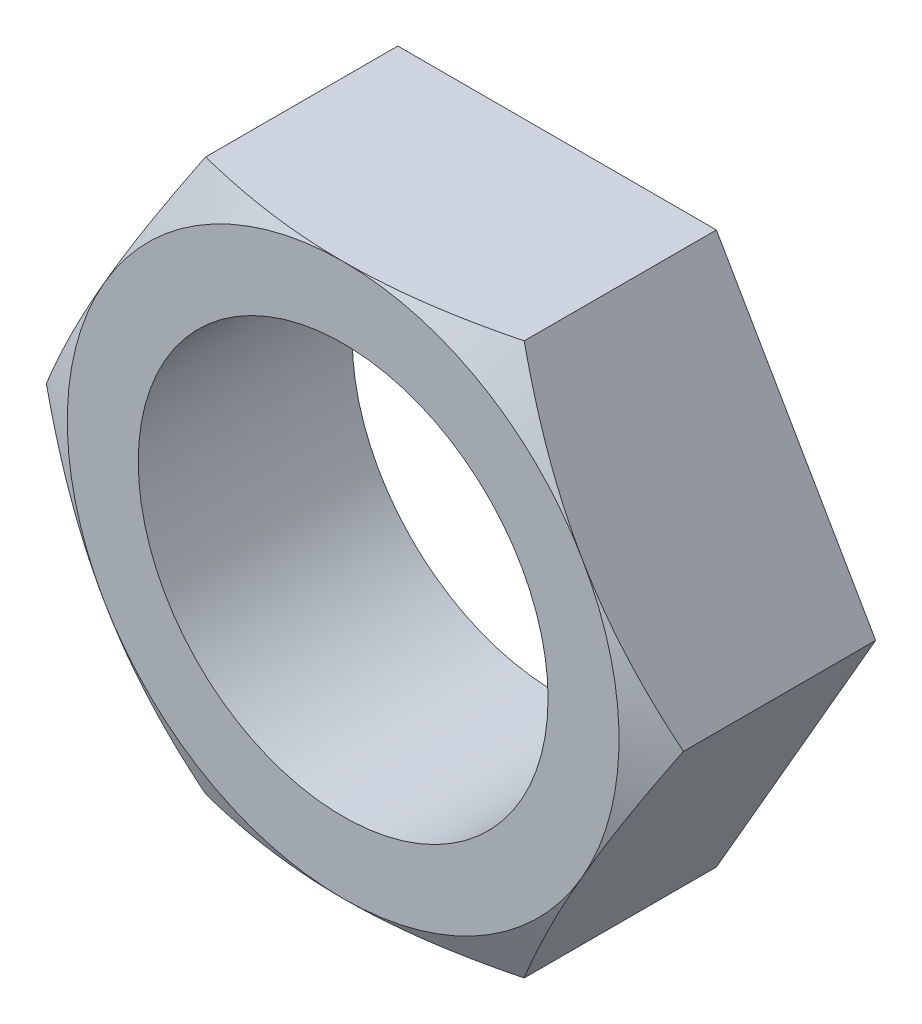
ISO-10303-21;
HEADER;
FILE_DESCRIPTION(('STEP AP214'),'2;1');
FILE_NAME('part.step','',(''),(''),'','','');
FILE_SCHEMA(('AUTOMOTIVE_DESIGN { 1 0 10303 214 1 1 1 1 }'));
ENDSEC;
DATA;
#1=APPLICATION_CONTEXT('core data for automotive mechanical design processes');
#2=APPLICATION_PROTOCOL_DEFINITION('international standard','automotive_design',2000,#1);
#3=PRODUCT_CONTEXT('',#1,'mechanical');
#4=PRODUCT('Part','Part','',(#3));
#5=PRODUCT_RELATED_PRODUCT_CATEGORY('part','',(#4));
#6=PRODUCT_DEFINITION_FORMATION('','',#4);
#7=PRODUCT_DEFINITION_CONTEXT('part definition',#1,'design');
#8=PRODUCT_DEFINITION('design','',#6,#7);
#9=PRODUCT_DEFINITION_SHAPE('','',#8);
#10=(LENGTH_UNIT() NAMED_UNIT(*) SI_UNIT(.MILLI.,.METRE.));
#11=(NAMED_UNIT(*) PLANE_ANGLE_UNIT() SI_UNIT($,.RADIAN.));
#12=(NAMED_UNIT(*) SI_UNIT($,.STERADIAN.) SOLID_ANGLE_UNIT());
#13=UNCERTAINTY_MEASURE_WITH_UNIT(LENGTH_MEASURE(1.E-05),#10,'distance_accuracy_value','');
#14=(GEOMETRIC_REPRESENTATION_CONTEXT(3) GLOBAL_UNCERTAINTY_ASSIGNED_CONTEXT((#13)) GLOBAL_UNIT_ASSIGNED_CONTEXT((#10,
#11,#12)) REPRESENTATION_CONTEXT('',''));
#15=CARTESIAN_POINT('',(0.,0.,0.));
#16=DIRECTION('',(0.,0.,1.));
#17=DIRECTION('',(1.,0.,0.));
#18=AXIS2_PLACEMENT_3D('',#15,#16,#17);
#19=CARTESIAN_POINT('',(147.07060395356,1381.2218281699,123.976608288254));
#20=DIRECTION('',(0.866025403784434,-0.500000000000007,0.));
#21=DIRECTION('',(0.500000000000007,0.866025403784434,0.));
#22=AXIS2_PLACEMENT_3D('',#19,#20,#21);
#23=PLANE('',#22);
#24=CARTESIAN_POINT('',(147.070719423614,1381.2220281699,21.3919278692892));
#25=CARTESIAN_POINT('',(146.580470792881,1380.37289263313,21.6417046290043));
#26=CARTESIAN_POINT('',(146.088283996036,1379.52040009418,21.8769733663679));
#27=CARTESIAN_POINT('',(145.099927293063,1377.80851606863,22.3137023874053));
#28=CARTESIAN_POINT('',(144.603755497762,1376.94912130988,22.5151455063238));
#29=CARTESIAN_POINT('',(143.607012208054,1375.22271129001,22.8794628681463));
#30=CARTESIAN_POINT('',(143.10643489137,1374.35568594439,23.0422741440836));
#31=CARTESIAN_POINT('',(142.102261938455,1372.61640737036,23.3240694413077));
#32=CARTESIAN_POINT('',(141.598666825295,1371.74415504792,23.4430608465895));
#33=CARTESIAN_POINT('',(140.600914799346,1370.01599784562,23.6310032152789));
#34=CARTESIAN_POINT('',(140.106810058655,1369.16018333049,23.7010513372338));
#35=CARTESIAN_POINT('',(139.117443596861,1367.44655035135,23.7929958306863));
#36=CARTESIAN_POINT('',(138.622181822608,1366.5887317953,23.8148899448458));
#37=CARTESIAN_POINT('',(137.632281032135,1364.87417333175,23.8096982247025));
#38=CARTESIAN_POINT('',(137.137641937828,1364.017433289,23.782667033308));
#39=CARTESIAN_POINT('',(136.14963623759,1362.30615721802,23.6807404823272));
#40=CARTESIAN_POINT('',(135.656269529059,1361.45162101208,23.6058491113049));
#41=CARTESIAN_POINT('',(134.919890015754,1360.17617428138,23.4600252252282));
#42=CARTESIAN_POINT('',(134.6760003469,1359.75374498349,23.4061148153264));
#43=CARTESIAN_POINT('',(134.188884668478,1358.9100358793,23.2876390773393));
#44=CARTESIAN_POINT('',(133.945658615883,1358.48875599848,23.2230744575704));
#45=CARTESIAN_POINT('',(133.21699643025,1357.22667607141,23.0140896973095));
#46=CARTESIAN_POINT('',(132.73264065915,1356.38774726692,22.8543916470237));
#47=CARTESIAN_POINT('',(131.761505215448,1354.7056913374,22.4964947671884));
#48=CARTESIAN_POINT('',(131.274766865267,1353.8626357849,22.2978544405525));
#49=CARTESIAN_POINT('',(130.30516492159,1352.18323595533,21.8680955136689));
#50=CARTESIAN_POINT('',(129.822299286033,1351.34688814132,21.6369954077479));
#51=CARTESIAN_POINT('',(129.341288483506,1350.51375299235,21.3919278692892));
#52=B_SPLINE_CURVE_WITH_KNOTS('',3,(#24,#25,#26,#27,#28,#29,#30,#31,#32,#33,#34,#35,#36,#37,#38,
#39,#40,#41,#42,#43,#44,#45,#46,#47,#48,#49,#50,#51),.UNSPECIFIED.,.F.,.F.,(4,2,2,2,2,2,2,2,2,2,
2,2,2,4),(0.,3.03558638203784,6.07270854259094,9.11474748966,12.1562735942813,15.1272181043355,
18.0983018817831,21.0660694103388,24.0335896438093,25.5057384868417,26.9777894974265,
29.922279495167,32.9023144399483,35.8806583121157),.UNSPECIFIED.);
#53=CARTESIAN_POINT('',(147.07060395356,1381.2218281699,21.3919867045077));
#54=VERTEX_POINT('',#53);
#55=CARTESIAN_POINT('',(138.20600395356,1365.86789058112,23.8125000000008));
#56=VERTEX_POINT('',#55);
#57=EDGE_CURVE('E109',#54,#56,#52,.T.);
#58=ORIENTED_EDGE('',*,*,#57,.F.);
#59=DIRECTION('',(0.,0.,-1.));
#60=VECTOR('',#59,1.);
#61=CARTESIAN_POINT('',(147.07060395356,1381.2218281699,123.976608288254));
#62=LINE('',#61,#60);
#63=CARTESIAN_POINT('',(147.07060395356,1381.2218281699,0.));
#64=VERTEX_POINT('',#63);
#65=EDGE_CURVE('E233',#54,#64,#62,.T.);
#66=ORIENTED_EDGE('',*,*,#65,.T.);
#67=DIRECTION('',(-0.500000000000007,-0.866025403784434,0.));
#68=VECTOR('',#67,1.);
#69=CARTESIAN_POINT('',(147.07060395356,1381.2218281699,0.));
#70=LINE('',#69,#68);
#71=CARTESIAN_POINT('',(129.34140395356,1350.51395299235,0.));
#72=VERTEX_POINT('',#71);
#73=EDGE_CURVE('E234',#64,#72,#70,.T.);
#74=ORIENTED_EDGE('',*,*,#73,.T.);
#75=DIRECTION('',(0.,0.,-1.));
#76=VECTOR('',#75,1.);
#77=CARTESIAN_POINT('',(129.34140395356,1350.51395299235,123.976608288254));
#78=LINE('',#77,#76);
#79=CARTESIAN_POINT('',(129.34140395356,1350.51395299235,21.3919867045076));
#80=VERTEX_POINT('',#79);
#81=EDGE_CURVE('E137',#80,#72,#78,.T.);
#82=ORIENTED_EDGE('',*,*,#81,.F.);
#83=EDGE_CURVE('E120',#56,#80,#52,.T.);
#84=ORIENTED_EDGE('',*,*,#83,.F.);
#85=EDGE_LOOP('',(#58,#66,#74,#82,#84));
#86=FACE_BOUND('',#85,.T.);
#87=ADVANCED_FACE('F37',(#86),#23,.F.);
#88=CARTESIAN_POINT('',(129.34140395356,1350.51395299235,123.976608288254));
#89=DIRECTION('',(0.866025403784442,0.499999999999994,0.));
#90=DIRECTION('',(-0.499999999999994,0.866025403784442,0.));
#91=AXIS2_PLACEMENT_3D('',#88,#89,#90);
#92=PLANE('',#91);
#93=CARTESIAN_POINT('',(129.341288483506,1350.51415299235,21.3919278692892));
#94=CARTESIAN_POINT('',(129.831537114238,1349.66501745558,21.6417046290042));
#95=CARTESIAN_POINT('',(130.323723911084,1348.81252491663,21.8769733663678));
#96=CARTESIAN_POINT('',(131.312080614057,1347.10064089108,22.3137023874053));
#97=CARTESIAN_POINT('',(131.808252409357,1346.24124613233,22.5151455063237));
#98=CARTESIAN_POINT('',(132.804995699065,1344.51483611246,22.8794628681462));
#99=CARTESIAN_POINT('',(133.30557301575,1343.64781076684,23.0422741440836));
#100=CARTESIAN_POINT('',(134.309745968665,1341.90853219281,23.3240694413077));
#101=CARTESIAN_POINT('',(134.813341081825,1341.03627987037,23.4430608465895));
#102=CARTESIAN_POINT('',(135.811093107774,1339.30812266807,23.6310032152788));
#103=CARTESIAN_POINT('',(136.305197848465,1338.45230815294,23.7010513372338));
#104=CARTESIAN_POINT('',(137.294564310259,1336.7386751738,23.7929958306862));
#105=CARTESIAN_POINT('',(137.789826084512,1335.88085661775,23.8148899448458));
#106=CARTESIAN_POINT('',(138.779726874984,1334.1662981542,23.8096982247025));
#107=CARTESIAN_POINT('',(139.274365969291,1333.30955811145,23.782667033308));
#108=CARTESIAN_POINT('',(140.26237166953,1331.59828204047,23.6807404823272));
#109=CARTESIAN_POINT('',(140.75573837806,1330.74374583453,23.6058491113049));
#110=CARTESIAN_POINT('',(141.492117891365,1329.46829910383,23.4600252252282));
#111=CARTESIAN_POINT('',(141.73600756022,1329.04586980594,23.4061148153264));
#112=CARTESIAN_POINT('',(142.223123238642,1328.20216070175,23.2876390773393));
#113=CARTESIAN_POINT('',(142.466349291236,1327.78088082093,23.2230744575704));
#114=CARTESIAN_POINT('',(143.195011476869,1326.51880089386,23.0140896973095));
#115=CARTESIAN_POINT('',(143.679367247969,1325.67987208937,22.8543916470237));
#116=CARTESIAN_POINT('',(144.650502691672,1323.99781615985,22.4964947671883));
#117=CARTESIAN_POINT('',(145.137241041852,1323.15476060735,22.2978544405525));
#118=CARTESIAN_POINT('',(146.10684298553,1321.47536077778,21.8680955136689));
#119=CARTESIAN_POINT('',(146.589708621086,1320.63901296377,21.6369954077479));
#120=CARTESIAN_POINT('',(147.070719423613,1319.8058778148,21.3919278692892));
#121=B_SPLINE_CURVE_WITH_KNOTS('',3,(#93,#94,#95,#96,#97,#98,#99,#100,#101,#102,#103,#104,#105,
#106,#107,#108,#109,#110,#111,#112,#113,#114,#115,#116,#117,#118,#119,#120),.UNSPECIFIED.,.F.,
.F.,(4,2,2,2,2,2,2,2,2,2,2,2,2,4),(0.,3.03558638203781,6.0727085425909,9.11474748965993,
12.1562735942812,15.1272181043356,18.0983018817832,21.0660694103389,24.0335896438094,
25.5057384868415,26.9777894974267,29.9222794951672,32.9023144399483,35.8806583121156),.UNSPECIFIED.);
#122=CARTESIAN_POINT('',(138.20600395356,1335.16001540357,23.8125000000008));
#123=VERTEX_POINT('',#122);
#124=EDGE_CURVE('E127',#80,#123,#121,.T.);
#125=ORIENTED_EDGE('',*,*,#124,.F.);
#126=ORIENTED_EDGE('',*,*,#81,.T.);
#127=DIRECTION('',(0.499999999999994,-0.866025403784442,0.));
#128=VECTOR('',#127,1.);
#129=CARTESIAN_POINT('',(129.34140395356,1350.51395299235,0.));
#130=LINE('',#129,#128);
#131=CARTESIAN_POINT('',(147.070603953559,1319.8060778148,0.));
#132=VERTEX_POINT('',#131);
#133=EDGE_CURVE('E249',#72,#132,#130,.T.);
#134=ORIENTED_EDGE('',*,*,#133,.T.);
#135=DIRECTION('',(0.,0.,-1.));
#136=VECTOR('',#135,1.);
#137=CARTESIAN_POINT('',(147.070603953559,1319.8060778148,123.976608288254));
#138=LINE('',#137,#136);
#139=CARTESIAN_POINT('',(147.070603953559,1319.8060778148,21.3919867045077));
#140=VERTEX_POINT('',#139);
#141=EDGE_CURVE('E204',#140,#132,#138,.T.);
#142=ORIENTED_EDGE('',*,*,#141,.F.);
#143=EDGE_CURVE('E138',#123,#140,#121,.T.);
#144=ORIENTED_EDGE('',*,*,#143,.F.);
#145=EDGE_LOOP('',(#125,#126,#134,#142,#144));
#146=FACE_BOUND('',#145,.T.);
#147=ADVANCED_FACE('F192',(#146),#92,.F.);
#148=CARTESIAN_POINT('',(147.070603953559,1319.8060778148,123.976608288254));
#149=DIRECTION('',(0.,1.,0.));
#150=DIRECTION('',(-1.,0.,0.));
#151=AXIS2_PLACEMENT_3D('',#148,#149,#150);
#152=PLANE('',#151);
#153=CARTESIAN_POINT('',(117.771709021794,1319.8060778148,10.8409567621768));
#154=CARTESIAN_POINT('',(118.456911807854,1319.8060778148,11.1332749209905));
#155=CARTESIAN_POINT('',(119.142799303296,1319.8060778148,11.4239930974424));
#156=CARTESIAN_POINT('',(120.516086699451,1319.8060778148,12.001852866436));
#157=CARTESIAN_POINT('',(121.203486614713,1319.8060778148,12.2889944243928));
#158=CARTESIAN_POINT('',(122.580027360718,1319.8060778148,12.8593595943776));
#159=CARTESIAN_POINT('',(123.269168427127,1319.8060778148,13.1425826382681));
#160=CARTESIAN_POINT('',(124.649244401776,1319.8060778148,13.7046161150412));
#161=CARTESIAN_POINT('',(125.340179305927,1319.8060778148,13.9834265579677));
#162=CARTESIAN_POINT('',(127.421796474031,1319.8060778148,14.8148516356537));
#163=CARTESIAN_POINT('',(128.815462549204,1319.8060778148,15.3600354664249));
#164=CARTESIAN_POINT('',(131.612197010711,1319.8060778148,16.42563880378));
#165=CARTESIAN_POINT('',(133.0152650062,1319.8060778148,16.9460593325986));
#166=CARTESIAN_POINT('',(135.823309352538,1319.8060778148,17.9522574166504));
#167=CARTESIAN_POINT('',(137.228211056339,1319.8060778148,18.4382422110898));
#168=CARTESIAN_POINT('',(140.0511762563,1319.8060778148,19.3710139959994));
#169=CARTESIAN_POINT('',(141.469240674678,1319.8060778148,19.8177982166875));
#170=CARTESIAN_POINT('',(144.31828348994,1319.8060778148,20.6608160664175));
#171=CARTESIAN_POINT('',(145.749241074345,1319.8060778148,21.0571194547956));
#172=CARTESIAN_POINT('',(148.627149973403,1319.8060778148,21.7866205817215));
#173=CARTESIAN_POINT('',(150.074098105683,1319.8060778148,22.1198306457246));
#174=CARTESIAN_POINT('',(152.430331648247,1319.8060778148,22.5960899015803));
#175=CARTESIAN_POINT('',(153.334752254528,1319.8060778148,22.7632580244041));
#176=CARTESIAN_POINT('',(155.149219008547,1319.8060778148,23.0638467167844));
#177=CARTESIAN_POINT('',(156.059265017458,1319.8060778148,23.197268115783));
#178=CARTESIAN_POINT('',(157.883835527958,1319.8060778148,23.42691192005));
#179=CARTESIAN_POINT('',(158.798358805228,1319.8060778148,23.5231439759794));
#180=CARTESIAN_POINT('',(160.630757944938,1319.8060778148,23.6756764225213));
#181=CARTESIAN_POINT('',(161.548633791425,1319.8060778148,23.7319770028961));
#182=CARTESIAN_POINT('',(163.386507442713,1319.8060778148,23.8029000926338));
#183=CARTESIAN_POINT('',(164.306506126316,1319.8060778148,23.8175000573444));
#184=CARTESIAN_POINT('',(166.146199021455,1319.8060778148,23.8044811571944));
#185=CARTESIAN_POINT('',(167.0658932338,1319.8060778148,23.7768624054369));
#186=CARTESIAN_POINT('',(168.902986176128,1319.8060778148,23.6803064355593));
#187=CARTESIAN_POINT('',(169.8203851506,1319.8060778148,23.6113738243276));
#188=CARTESIAN_POINT('',(171.651374475858,1319.8060778148,23.4343128406343));
#189=CARTESIAN_POINT('',(172.564964743128,1319.8060778148,23.3261836132155));
#190=CARTESIAN_POINT('',(174.447081201838,1319.8060778148,23.0654414898965));
#191=CARTESIAN_POINT('',(175.415264447843,1319.8060778148,22.9103687047686));
#192=CARTESIAN_POINT('',(177.345078154972,1319.8060778148,22.5634158118414));
#193=CARTESIAN_POINT('',(178.306707777592,1319.8060778148,22.3715310823994));
#194=CARTESIAN_POINT('',(180.223431339038,1319.8060778148,21.9553572065387));
#195=CARTESIAN_POINT('',(181.178521416784,1319.8060778148,21.7310503993854));
#196=CARTESIAN_POINT('',(183.081624184154,1319.8060778148,21.2544637660428));
#197=CARTESIAN_POINT('',(184.029637085254,1319.8060778148,21.0021847793025));
#198=CARTESIAN_POINT('',(185.923233455325,1319.8060778148,20.4724108102008));
#199=CARTESIAN_POINT('',(186.868785994329,1319.8060778148,20.1948058011185));
#200=CARTESIAN_POINT('',(188.753554148018,1319.8060778148,19.6189165178223));
#201=CARTESIAN_POINT('',(189.69276971916,1319.8060778148,19.3206321016725));
#202=CARTESIAN_POINT('',(191.565169477271,1319.8060778148,18.7065206757264));
#203=CARTESIAN_POINT('',(192.498355112009,1319.8060778148,18.3906980658482));
#204=CARTESIAN_POINT('',(194.359492154287,1319.8060778148,17.7440384241465));
#205=CARTESIAN_POINT('',(195.287443579258,1319.8060778148,17.4132014423559));
#206=CARTESIAN_POINT('',(197.155106522538,1319.8060778148,16.7327061537367));
#207=CARTESIAN_POINT('',(198.094734079441,1319.8060778148,16.3828178891692));
#208=CARTESIAN_POINT('',(199.969673141043,1319.8060778148,15.6716813356268));
#209=CARTESIAN_POINT('',(200.904984642862,1319.8060778148,15.3104330390735));
#210=CARTESIAN_POINT('',(202.771843288172,1319.8060778148,14.5781611036866));
#211=CARTESIAN_POINT('',(203.703390162497,1319.8060778148,14.2071367796587));
#212=CARTESIAN_POINT('',(205.563092524498,1319.8060778148,13.4566813214079));
#213=CARTESIAN_POINT('',(206.491247995723,1319.8060778148,13.077250146469));
#214=CARTESIAN_POINT('',(208.333979859002,1319.8060778148,12.315478714202));
#215=CARTESIAN_POINT('',(209.248590400054,1319.8060778148,11.9332209761225));
#216=CARTESIAN_POINT('',(211.075196808108,1319.8060778148,11.1625061136868));
#217=CARTESIAN_POINT('',(211.987192667534,1319.8060778148,10.7740489713897));
#218=CARTESIAN_POINT('',(213.808628287385,1319.8060778148,9.99181335755288));
#219=CARTESIAN_POINT('',(214.718068627817,1319.8060778148,9.59803623533003));
#220=CARTESIAN_POINT('',(216.534853269485,1319.8060778148,8.80570673741764));
#221=CARTESIAN_POINT('',(217.442197597948,1319.8060778148,8.4071544241762));
#222=CARTESIAN_POINT('',(218.348621829151,1319.8060778148,8.00652975555705));
#223=B_SPLINE_CURVE_WITH_KNOTS('',3,(#153,#154,#155,#156,#157,#158,#159,#160,#161,#162,#163,
#164,#165,#166,#167,#168,#169,#170,#171,#172,#173,#174,#175,#176,#177,#178,#179,#180,#181,#182,
#183,#184,#185,#186,#187,#188,#189,#190,#191,#192,#193,#194,#195,#196,#197,#198,#199,#200,#201,
#202,#203,#204,#205,#206,#207,#208,#209,#210,#211,#212,#213,#214,#215,#216,#217,#218,#219,#220,
#221,#222),.UNSPECIFIED.,.F.,.F.,(4,2,2,2,2,2,2,2,2,2,2,2,2,2,2,2,2,2,2,2,2,2,2,2,2,2,2,2,2,2,2,
2,2,2,4),(0.,2.23485528231573,4.46973215830187,6.70492973875985,8.94012223073118,
13.4294441241623,17.9185805363038,22.3778839899908,26.8375022699264,31.2908893679087,
35.7434055848097,38.502087477098,41.2607015586652,44.0185992964405,46.7764839280523,
49.5358592760823,52.2952272318193,55.0542875490125,57.8134080504882,60.75417212283,
63.695305642251,66.6380473160167,69.5807007015746,72.536809519837,75.4929386297673,
78.4483294381269,81.4037103988812,84.4115968271565,87.4194852620602,90.4275850813453,
93.43569947263,96.4095096949025,99.3833285249037,102.356406754815,105.329446146312),.UNSPECIFIED.);
#224=CARTESIAN_POINT('',(164.79980395356,1319.8060778148,23.8125000000008));
#225=VERTEX_POINT('',#224);
#226=EDGE_CURVE('E187',#140,#225,#223,.T.);
#227=ORIENTED_EDGE('',*,*,#226,.F.);
#228=ORIENTED_EDGE('',*,*,#141,.T.);
#229=DIRECTION('',(1.,0.,0.));
#230=VECTOR('',#229,1.);
#231=CARTESIAN_POINT('',(147.070603953559,1319.8060778148,0.));
#232=LINE('',#231,#230);
#233=CARTESIAN_POINT('',(182.529003953559,1319.8060778148,0.));
#234=VERTEX_POINT('',#233);
#235=EDGE_CURVE('E217',#132,#234,#232,.T.);
#236=ORIENTED_EDGE('',*,*,#235,.T.);
#237=DIRECTION('',(0.,0.,-1.));
#238=VECTOR('',#237,1.);
#239=CARTESIAN_POINT('',(182.529003953559,1319.8060778148,123.976608288254));
#240=LINE('',#239,#238);
#241=CARTESIAN_POINT('',(182.529003953559,1319.8060778148,21.3919867045078));
#242=VERTEX_POINT('',#241);
#243=EDGE_CURVE('E215',#242,#234,#240,.T.);
#244=ORIENTED_EDGE('',*,*,#243,.F.);
#245=EDGE_CURVE('E182',#225,#242,#223,.T.);
#246=ORIENTED_EDGE('',*,*,#245,.F.);
#247=EDGE_LOOP('',(#227,#228,#236,#244,#246));
#248=FACE_BOUND('',#247,.T.);
#249=ADVANCED_FACE('F188',(#248),#152,.F.);
#250=CARTESIAN_POINT('',(182.529003953559,1319.8060778148,123.976608288254));
#251=DIRECTION('',(-0.866025403784435,0.500000000000006,0.));
#252=DIRECTION('',(-0.500000000000006,-0.866025403784435,0.));
#253=AXIS2_PLACEMENT_3D('',#250,#251,#252);
#254=PLANE('',#253);
#255=CARTESIAN_POINT('',(182.528888483506,1319.8058778148,21.3919278692893));
#256=CARTESIAN_POINT('',(183.019137114238,1320.65501335157,21.6417046290044));
#257=CARTESIAN_POINT('',(183.511323911084,1321.50750589052,21.8769733663679));
#258=CARTESIAN_POINT('',(184.499680614056,1323.21938991607,22.3137023874054));
#259=CARTESIAN_POINT('',(184.995852409357,1324.07878467481,22.5151455063238));
#260=CARTESIAN_POINT('',(185.992595699065,1325.80519469469,22.8794628681464));
#261=CARTESIAN_POINT('',(186.49317301575,1326.6722200403,23.0422741440837));
#262=CARTESIAN_POINT('',(187.497345968665,1328.41149861434,23.3240694413079));
#263=CARTESIAN_POINT('',(188.000941081824,1329.28375093678,23.4430608465896));
#264=CARTESIAN_POINT('',(188.998693107774,1331.01190813907,23.631003215279));
#265=CARTESIAN_POINT('',(189.492797848464,1331.86772265421,23.701051337234));
#266=CARTESIAN_POINT('',(190.482164310258,1333.58135563334,23.7929958306865));
#267=CARTESIAN_POINT('',(190.977426084511,1334.4391741894,23.814889944846));
#268=CARTESIAN_POINT('',(191.967326874984,1336.15373265295,23.8096982247027));
#269=CARTESIAN_POINT('',(192.461965969291,1337.0104726957,23.7826670333082));
#270=CARTESIAN_POINT('',(193.44997166953,1338.72174876668,23.6807404823274));
#271=CARTESIAN_POINT('',(193.94333837806,1339.57628497262,23.6058491113051));
#272=CARTESIAN_POINT('',(194.679717891365,1340.85173170331,23.4600252252285));
#273=CARTESIAN_POINT('',(194.923607560219,1341.27416100121,23.4061148153266));
#274=CARTESIAN_POINT('',(195.410723238642,1342.1178701054,23.2876390773395));
#275=CARTESIAN_POINT('',(195.653949291236,1342.53914998622,23.2230744575706));
#276=CARTESIAN_POINT('',(196.38261147687,1343.80122991329,23.0140896973097));
#277=CARTESIAN_POINT('',(196.866967247969,1344.64015871777,22.8543916470239));
#278=CARTESIAN_POINT('',(197.838102691672,1346.3222146473,22.4964947671886));
#279=CARTESIAN_POINT('',(198.324841041852,1347.1652701998,22.2978544405527));
#280=CARTESIAN_POINT('',(199.29444298553,1348.84467002937,21.8680955136691));
#281=CARTESIAN_POINT('',(199.777308621086,1349.68101784338,21.6369954077481));
#282=CARTESIAN_POINT('',(200.258319423613,1350.51415299235,21.3919278692894));
#283=B_SPLINE_CURVE_WITH_KNOTS('',3,(#255,#256,#257,#258,#259,#260,#261,#262,#263,#264,#265,
#266,#267,#268,#269,#270,#271,#272,#273,#274,#275,#276,#277,#278,#279,#280,#281,#282),
.UNSPECIFIED.,.F.,.F.,(4,2,2,2,2,2,2,2,2,2,2,2,2,4),(0.,3.03558638203759,6.07270854259068,
9.11474748965951,12.1562735942811,15.1272181043353,18.0983018817828,21.0660694103388,
24.0335896438093,25.5057384868417,26.9777894974268,29.9222794951672,32.9023144399485,
35.8806583121159),.UNSPECIFIED.);
#284=CARTESIAN_POINT('',(191.39360395356,1335.16001540357,23.8125000000008));
#285=VERTEX_POINT('',#284);
#286=EDGE_CURVE('E61',#242,#285,#283,.T.);
#287=ORIENTED_EDGE('',*,*,#286,.F.);
#288=ORIENTED_EDGE('',*,*,#243,.T.);
#289=DIRECTION('',(0.500000000000006,0.866025403784435,0.));
#290=VECTOR('',#289,1.);
#291=CARTESIAN_POINT('',(182.529003953559,1319.8060778148,0.));
#292=LINE('',#291,#290);
#293=CARTESIAN_POINT('',(200.25820395356,1350.51395299235,0.));
#294=VERTEX_POINT('',#293);
#295=EDGE_CURVE('E221',#234,#294,#292,.T.);
#296=ORIENTED_EDGE('',*,*,#295,.T.);
#297=DIRECTION('',(0.,0.,-1.));
#298=VECTOR('',#297,1.);
#299=CARTESIAN_POINT('',(200.25820395356,1350.51395299235,123.976608288254));
#300=LINE('',#299,#298);
#301=CARTESIAN_POINT('',(200.25820395356,1350.51395299235,21.3919867045078));
#302=VERTEX_POINT('',#301);
#303=EDGE_CURVE('E223',#302,#294,#300,.T.);
#304=ORIENTED_EDGE('',*,*,#303,.F.);
#305=EDGE_CURVE('E177',#285,#302,#283,.T.);
#306=ORIENTED_EDGE('',*,*,#305,.F.);
#307=EDGE_LOOP('',(#287,#288,#296,#304,#306));
#308=FACE_BOUND('',#307,.T.);
#309=ADVANCED_FACE('F191',(#308),#254,.F.);
#310=CARTESIAN_POINT('',(200.25820395356,1350.51395299235,123.976608288254));
#311=DIRECTION('',(-0.866025403784442,-0.499999999999994,0.));
#312=DIRECTION('',(0.499999999999994,-0.866025403784442,0.));
#313=AXIS2_PLACEMENT_3D('',#310,#311,#312);
#314=PLANE('',#313);
#315=CARTESIAN_POINT('',(200.258319423613,1350.51375299235,21.3919278692894));
#316=CARTESIAN_POINT('',(199.768070792881,1351.36288852912,21.6417046290044));
#317=CARTESIAN_POINT('',(199.275883996035,1352.21538106807,21.8769733663679));
#318=CARTESIAN_POINT('',(198.287527293063,1353.92726509362,22.3137023874054));
#319=CARTESIAN_POINT('',(197.791355497762,1354.78665985236,22.5151455063238));
#320=CARTESIAN_POINT('',(196.794612208054,1356.51306987224,22.8794628681463));
#321=CARTESIAN_POINT('',(196.29403489137,1357.38009521785,23.0422741440837));
#322=CARTESIAN_POINT('',(195.289861938454,1359.11937379189,23.3240694413078));
#323=CARTESIAN_POINT('',(194.786266825295,1359.99162611433,23.4430608465896));
#324=CARTESIAN_POINT('',(193.788514799345,1361.71978331663,23.631003215279));
#325=CARTESIAN_POINT('',(193.294410058655,1362.57559783176,23.7010513372339));
#326=CARTESIAN_POINT('',(192.305043596861,1364.28923081089,23.7929958306864));
#327=CARTESIAN_POINT('',(191.809781822608,1365.14704936695,23.8148899448459));
#328=CARTESIAN_POINT('',(190.819881032135,1366.8616078305,23.8096982247026));
#329=CARTESIAN_POINT('',(190.325241937828,1367.71834787325,23.782667033308));
#330=CARTESIAN_POINT('',(189.337236237589,1369.42962394423,23.6807404823272));
#331=CARTESIAN_POINT('',(188.843869529059,1370.28416015017,23.6058491113049));
#332=CARTESIAN_POINT('',(188.107490015754,1371.55960688086,23.4600252252283));
#333=CARTESIAN_POINT('',(187.8636003469,1371.98203617876,23.4061148153265));
#334=CARTESIAN_POINT('',(187.376484668478,1372.82574528295,23.2876390773393));
#335=CARTESIAN_POINT('',(187.133258615883,1373.24702516377,23.2230744575704));
#336=CARTESIAN_POINT('',(186.40459643025,1374.50910509084,23.0140896973096));
#337=CARTESIAN_POINT('',(185.92024065915,1375.34803389532,22.8543916470237));
#338=CARTESIAN_POINT('',(184.949105215448,1377.03008982485,22.4964947671884));
#339=CARTESIAN_POINT('',(184.462366865268,1377.87314537735,22.2978544405526));
#340=CARTESIAN_POINT('',(183.49276492159,1379.55254520692,21.868095513669));
#341=CARTESIAN_POINT('',(183.009899286034,1380.38889302093,21.636995407748));
#342=CARTESIAN_POINT('',(182.528888483506,1381.2220281699,21.3919278692893));
#343=B_SPLINE_CURVE_WITH_KNOTS('',3,(#315,#316,#317,#318,#319,#320,#321,#322,#323,#324,#325,
#326,#327,#328,#329,#330,#331,#332,#333,#334,#335,#336,#337,#338,#339,#340,#341,#342),
.UNSPECIFIED.,.F.,.F.,(4,2,2,2,2,2,2,2,2,2,2,2,2,4),(0.,3.03558638203755,6.07270854259063,
9.11474748965968,12.1562735942812,15.1272181043356,18.0983018817832,21.0660694103389,
24.0335896438094,25.5057384868417,26.9777894974267,29.9222794951669,32.902314439948,
35.8806583121153),.UNSPECIFIED.);
#344=CARTESIAN_POINT('',(191.39360395356,1365.86789058112,23.8125000000008));
#345=VERTEX_POINT('',#344);
#346=EDGE_CURVE('E53',#302,#345,#343,.T.);
#347=ORIENTED_EDGE('',*,*,#346,.F.);
#348=ORIENTED_EDGE('',*,*,#303,.T.);
#349=DIRECTION('',(-0.499999999999994,0.866025403784442,0.));
#350=VECTOR('',#349,1.);
#351=CARTESIAN_POINT('',(200.25820395356,1350.51395299235,0.));
#352=LINE('',#351,#350);
#353=CARTESIAN_POINT('',(182.52900395356,1381.2218281699,0.));
#354=VERTEX_POINT('',#353);
#355=EDGE_CURVE('E230',#294,#354,#352,.T.);
#356=ORIENTED_EDGE('',*,*,#355,.T.);
#357=DIRECTION('',(0.,0.,-1.));
#358=VECTOR('',#357,1.);
#359=CARTESIAN_POINT('',(182.52900395356,1381.2218281699,123.976608288254));
#360=LINE('',#359,#358);
#361=CARTESIAN_POINT('',(182.52900395356,1381.2218281699,21.3919867045077));
#362=VERTEX_POINT('',#361);
#363=EDGE_CURVE('E231',#362,#354,#360,.T.);
#364=ORIENTED_EDGE('',*,*,#363,.F.);
#365=EDGE_CURVE('E170',#345,#362,#343,.T.);
#366=ORIENTED_EDGE('',*,*,#365,.F.);
#367=EDGE_LOOP('',(#347,#348,#356,#364,#366));
#368=FACE_BOUND('',#367,.T.);
#369=ADVANCED_FACE('F269',(#368),#314,.F.);
#370=CARTESIAN_POINT('',(182.52900395356,1381.2218281699,123.976608288254));
#371=DIRECTION('',(0.,-1.,0.));
#372=DIRECTION('',(1.,0.,0.));
#373=AXIS2_PLACEMENT_3D('',#370,#371,#372);
#374=PLANE('',#373);
#375=CARTESIAN_POINT('',(117.771709021795,1381.2218281699,10.8409567621768));
#376=CARTESIAN_POINT('',(118.456911807854,1381.2218281699,11.1332749209905));
#377=CARTESIAN_POINT('',(119.142799303296,1381.2218281699,11.4239930974424));
#378=CARTESIAN_POINT('',(120.516086699451,1381.2218281699,12.001852866436));
#379=CARTESIAN_POINT('',(121.203486614713,1381.2218281699,12.2889944243928));
#380=CARTESIAN_POINT('',(122.580027360718,1381.2218281699,12.8593595943776));
#381=CARTESIAN_POINT('',(123.269168427128,1381.2218281699,13.1425826382682));
#382=CARTESIAN_POINT('',(124.649244401776,1381.2218281699,13.7046161150412));
#383=CARTESIAN_POINT('',(125.340179305927,1381.2218281699,13.9834265579677));
#384=CARTESIAN_POINT('',(127.421796474032,1381.2218281699,14.8148516356538));
#385=CARTESIAN_POINT('',(128.815462549204,1381.2218281699,15.3600354664249));
#386=CARTESIAN_POINT('',(131.612197010712,1381.2218281699,16.42563880378));
#387=CARTESIAN_POINT('',(133.0152650062,1381.2218281699,16.9460593325986));
#388=CARTESIAN_POINT('',(135.823309352538,1381.2218281699,17.9522574166504));
#389=CARTESIAN_POINT('',(137.22821105634,1381.2218281699,18.4382422110898));
#390=CARTESIAN_POINT('',(140.051176256301,1381.2218281699,19.3710139959995));
#391=CARTESIAN_POINT('',(141.469240674678,1381.2218281699,19.8177982166876));
#392=CARTESIAN_POINT('',(144.31828348994,1381.2218281699,20.6608160664175));
#393=CARTESIAN_POINT('',(145.749241074345,1381.2218281699,21.0571194547956));
#394=CARTESIAN_POINT('',(148.627149973403,1381.2218281699,21.7866205817215));
#395=CARTESIAN_POINT('',(150.074098105684,1381.2218281699,22.1198306457246));
#396=CARTESIAN_POINT('',(152.430331648247,1381.2218281699,22.5960899015803));
#397=CARTESIAN_POINT('',(153.334752254528,1381.2218281699,22.7632580244041));
#398=CARTESIAN_POINT('',(155.149219008547,1381.2218281699,23.0638467167844));
#399=CARTESIAN_POINT('',(156.059265017458,1381.2218281699,23.197268115783));
#400=CARTESIAN_POINT('',(157.883835527958,1381.2218281699,23.42691192005));
#401=CARTESIAN_POINT('',(158.798358805228,1381.2218281699,23.5231439759794));
#402=CARTESIAN_POINT('',(160.630757944938,1381.2218281699,23.6756764225213));
#403=CARTESIAN_POINT('',(161.548633791425,1381.2218281699,23.7319770028961));
#404=CARTESIAN_POINT('',(163.386507442713,1381.2218281699,23.8029000926338));
#405=CARTESIAN_POINT('',(164.306506126316,1381.2218281699,23.8175000573444));
#406=CARTESIAN_POINT('',(166.146199021456,1381.2218281699,23.8044811571944));
#407=CARTESIAN_POINT('',(167.0658932338,1381.2218281699,23.7768624054369));
#408=CARTESIAN_POINT('',(168.902986176129,1381.2218281699,23.6803064355593));
#409=CARTESIAN_POINT('',(169.820385150601,1381.2218281699,23.6113738243276));
#410=CARTESIAN_POINT('',(171.651374475858,1381.2218281699,23.4343128406343));
#411=CARTESIAN_POINT('',(172.564964743128,1381.2218281699,23.3261836132155));
#412=CARTESIAN_POINT('',(174.447081201839,1381.2218281699,23.0654414898965));
#413=CARTESIAN_POINT('',(175.415264447844,1381.2218281699,22.9103687047686));
#414=CARTESIAN_POINT('',(177.345078154973,1381.2218281699,22.5634158118414));
#415=CARTESIAN_POINT('',(178.306707777592,1381.2218281699,22.3715310823994));
#416=CARTESIAN_POINT('',(180.223431339039,1381.2218281699,21.9553572065387));
#417=CARTESIAN_POINT('',(181.178521416784,1381.2218281699,21.7310503993854));
#418=CARTESIAN_POINT('',(183.081624184154,1381.2218281699,21.2544637660428));
#419=CARTESIAN_POINT('',(184.029637085255,1381.2218281699,21.0021847793025));
#420=CARTESIAN_POINT('',(185.923233455326,1381.2218281699,20.4724108102008));
#421=CARTESIAN_POINT('',(186.868785994329,1381.2218281699,20.1948058011185));
#422=CARTESIAN_POINT('',(188.753554148018,1381.2218281699,19.6189165178223));
#423=CARTESIAN_POINT('',(189.692769719161,1381.2218281699,19.3206321016724));
#424=CARTESIAN_POINT('',(191.565169477271,1381.2218281699,18.7065206757263));
#425=CARTESIAN_POINT('',(192.498355112009,1381.2218281699,18.3906980658481));
#426=CARTESIAN_POINT('',(194.359492154287,1381.2218281699,17.7440384241465));
#427=CARTESIAN_POINT('',(195.287443579258,1381.2218281699,17.4132014423558));
#428=CARTESIAN_POINT('',(197.155106522539,1381.2218281699,16.7327061537366));
#429=CARTESIAN_POINT('',(198.094734079442,1381.2218281699,16.3828178891691));
#430=CARTESIAN_POINT('',(199.969673141043,1381.2218281699,15.6716813356267));
#431=CARTESIAN_POINT('',(200.904984642862,1381.2218281699,15.3104330390734));
#432=CARTESIAN_POINT('',(202.771843288172,1381.2218281699,14.5781611036865));
#433=CARTESIAN_POINT('',(203.703390162498,1381.2218281699,14.2071367796586));
#434=CARTESIAN_POINT('',(205.563092524499,1381.2218281699,13.4566813214078));
#435=CARTESIAN_POINT('',(206.491247995724,1381.2218281699,13.0772501464689));
#436=CARTESIAN_POINT('',(208.333979859002,1381.2218281699,12.3154787142019));
#437=CARTESIAN_POINT('',(209.248590400054,1381.2218281699,11.9332209761224));
#438=CARTESIAN_POINT('',(211.075196808109,1381.2218281699,11.1625061136867));
#439=CARTESIAN_POINT('',(211.987192667535,1381.2218281699,10.7740489713895));
#440=CARTESIAN_POINT('',(213.808628287386,1381.2218281699,9.99181335755276));
#441=CARTESIAN_POINT('',(214.718068627818,1381.2218281699,9.5980362353299));
#442=CARTESIAN_POINT('',(216.534853269486,1381.2218281699,8.80570673741751));
#443=CARTESIAN_POINT('',(217.442197597948,1381.2218281699,8.40715442417606));
#444=CARTESIAN_POINT('',(218.348621829152,1381.2218281699,8.00652975555691));
#445=B_SPLINE_CURVE_WITH_KNOTS('',3,(#375,#376,#377,#378,#379,#380,#381,#382,#383,#384,#385,
#386,#387,#388,#389,#390,#391,#392,#393,#394,#395,#396,#397,#398,#399,#400,#401,#402,#403,#404,
#405,#406,#407,#408,#409,#410,#411,#412,#413,#414,#415,#416,#417,#418,#419,#420,#421,#422,#423,
#424,#425,#426,#427,#428,#429,#430,#431,#432,#433,#434,#435,#436,#437,#438,#439,#440,#441,#442,
#443,#444),.UNSPECIFIED.,.F.,.F.,(4,2,2,2,2,2,2,2,2,2,2,2,2,2,2,2,2,2,2,2,2,2,2,2,2,2,2,2,2,2,2,
2,2,2,4),(0.,2.23485528231572,4.46973215830187,6.70492973875983,8.94012223073115,
13.4294441241622,17.9185805363038,22.3778839899907,26.8375022699263,31.2908893679087,
35.7434055848097,38.502087477098,41.2607015586651,44.0185992964405,46.7764839280523,
49.5358592760823,52.2952272318192,55.0542875490125,57.8134080504881,60.7541721228299,
63.6953056422509,66.6380473160167,69.5807007015746,72.536809519837,75.4929386297674,
78.448329438127,81.4037103988813,84.4115968271566,87.4194852620604,90.4275850813455,
93.4356994726302,96.4095096949027,99.3833285249039,102.356406754815,105.329446146313),.UNSPECIFIED.);
#446=CARTESIAN_POINT('',(164.79980395356,1381.2218281699,23.8125000000008));
#447=VERTEX_POINT('',#446);
#448=EDGE_CURVE('E365',#362,#447,#445,.F.);
#449=ORIENTED_EDGE('',*,*,#448,.F.);
#450=ORIENTED_EDGE('',*,*,#363,.T.);
#451=DIRECTION('',(-1.,0.,0.));
#452=VECTOR('',#451,1.);
#453=CARTESIAN_POINT('',(182.52900395356,1381.2218281699,0.));
#454=LINE('',#453,#452);
#455=EDGE_CURVE('E151',#354,#64,#454,.T.);
#456=ORIENTED_EDGE('',*,*,#455,.T.);
#457=ORIENTED_EDGE('',*,*,#65,.F.);
#458=EDGE_CURVE('E115',#447,#54,#445,.F.);
#459=ORIENTED_EDGE('',*,*,#458,.F.);
#460=EDGE_LOOP('',(#449,#450,#456,#457,#459));
#461=FACE_BOUND('',#460,.T.);
#462=ADVANCED_FACE('F243',(#461),#374,.F.);
#463=CARTESIAN_POINT('',(164.79980395356,2028.05100619533,23.8125000000008));
#464=DIRECTION('',(0.,0.,-1.));
#465=DIRECTION('',(-1.,0.,0.));
#466=AXIS2_PLACEMENT_3D('',#463,#464,#465);
#467=PLANE('',#466);
#468=CARTESIAN_POINT('',(164.79980395356,1350.51395299235,23.8125000000008));
#469=DIRECTION('',(0.,0.,-1.));
#470=DIRECTION('',(-1.,0.,0.));
#471=AXIS2_PLACEMENT_3D('',#468,#469,#470);
#472=CIRCLE('',#471,22.8092000000001);
#473=CARTESIAN_POINT('',(141.99060395356,1350.51395299235,23.8125000000008));
#474=VERTEX_POINT('',#473);
#475=EDGE_CURVE('E132',#474,#474,#472,.T.);
#476=ORIENTED_EDGE('',*,*,#475,.T.);
#477=EDGE_LOOP('',(#476));
#478=FACE_BOUND('',#477,.T.);
#479=CARTESIAN_POINT('',(164.79980395356,1350.51395299235,23.8125000000008));
#480=DIRECTION('',(0.,0.,-1.));
#481=DIRECTION('',(-1.,0.,0.));
#482=AXIS2_PLACEMENT_3D('',#479,#480,#481);
#483=CIRCLE('',#482,30.7078751775504);
#484=EDGE_CURVE('E12',#56,#447,#483,.T.);
#485=ORIENTED_EDGE('',*,*,#484,.F.);
#486=EDGE_CURVE('E41',#123,#56,#483,.T.);
#487=ORIENTED_EDGE('',*,*,#486,.F.);
#488=EDGE_CURVE('E131',#225,#123,#483,.T.);
#489=ORIENTED_EDGE('',*,*,#488,.F.);
#490=EDGE_CURVE('E210',#285,#225,#483,.T.);
#491=ORIENTED_EDGE('',*,*,#490,.F.);
#492=EDGE_CURVE('E46',#345,#285,#483,.T.);
#493=ORIENTED_EDGE('',*,*,#492,.F.);
#494=CARTESIAN_POINT('',(164.79980395356,1350.51395299235,23.8125000000008));
#495=DIRECTION('',(0.,0.,1.));
#496=DIRECTION('',(1.,0.,0.));
#497=AXIS2_PLACEMENT_3D('',#494,#495,#496);
#498=CIRCLE('',#497,30.7078751775504);
#499=EDGE_CURVE('E134',#345,#447,#498,.T.);
#500=ORIENTED_EDGE('',*,*,#499,.T.);
#501=EDGE_LOOP('',(#485,#487,#489,#491,#493,#500));
#502=FACE_BOUND('',#501,.T.);
#503=ADVANCED_FACE('F39',(#478,#502),#467,.F.);
#504=CARTESIAN_POINT('',(0.,0.,0.));
#505=DIRECTION('',(0.,0.,1.));
#506=DIRECTION('',(1.,0.,0.));
#507=AXIS2_PLACEMENT_3D('',#504,#505,#506);
#508=PLANE('',#507);
#509=ORIENTED_EDGE('',*,*,#73,.F.);
#510=ORIENTED_EDGE('',*,*,#455,.F.);
#511=ORIENTED_EDGE('',*,*,#355,.F.);
#512=ORIENTED_EDGE('',*,*,#295,.F.);
#513=ORIENTED_EDGE('',*,*,#235,.F.);
#514=ORIENTED_EDGE('',*,*,#133,.F.);
#515=EDGE_LOOP('',(#509,#510,#511,#512,#513,#514));
#516=FACE_BOUND('',#515,.T.);
#517=CARTESIAN_POINT('',(164.79980395356,1350.51395299235,0.));
#518=DIRECTION('',(0.,0.,1.));
#519=DIRECTION('',(1.,0.,0.));
#520=AXIS2_PLACEMENT_3D('',#517,#518,#519);
#521=CIRCLE('',#520,22.8092000000001);
#522=CARTESIAN_POINT('',(187.60900395356,1350.51395299235,0.));
#523=VERTEX_POINT('',#522);
#524=EDGE_CURVE('E119',#523,#523,#521,.T.);
#525=ORIENTED_EDGE('',*,*,#524,.T.);
#526=EDGE_LOOP('',(#525));
#527=FACE_BOUND('',#526,.T.);
#528=ADVANCED_FACE('F158',(#516,#527),#508,.F.);
#529=CARTESIAN_POINT('',(164.79980395356,1350.51395299235,123.976608288254));
#530=DIRECTION('',(0.,0.,-1.));
#531=DIRECTION('',(-1.,0.,0.));
#532=AXIS2_PLACEMENT_3D('',#529,#530,#531);
#533=CYLINDRICAL_SURFACE('',#532,22.8092000000001);
#534=ORIENTED_EDGE('',*,*,#475,.F.);
#535=EDGE_LOOP('',(#534));
#536=FACE_BOUND('',#535,.T.);
#537=ORIENTED_EDGE('',*,*,#524,.F.);
#538=EDGE_LOOP('',(#537));
#539=FACE_BOUND('',#538,.T.);
#540=ADVANCED_FACE('F256',(#536,#539),#533,.F.);
#541=CARTESIAN_POINT('',(164.79980395356,1350.51395299235,23.8125000000008));
#542=DIRECTION('',(0.,0.,-1.));
#543=DIRECTION('',(1.,0.,0.));
#544=AXIS2_PLACEMENT_3D('',#541,#542,#543);
#545=CONICAL_SURFACE('',#544,30.7078751775504,1.09955742875643);
#546=ORIENTED_EDGE('',*,*,#83,.T.);
#547=ORIENTED_EDGE('',*,*,#124,.T.);
#548=ORIENTED_EDGE('',*,*,#486,.T.);
#549=EDGE_LOOP('',(#546,#547,#548));
#550=FACE_BOUND('',#549,.T.);
#551=ADVANCED_FACE('F125',(#550),#545,.T.);
#552=ORIENTED_EDGE('',*,*,#143,.T.);
#553=ORIENTED_EDGE('',*,*,#226,.T.);
#554=ORIENTED_EDGE('',*,*,#488,.T.);
#555=EDGE_LOOP('',(#552,#553,#554));
#556=FACE_BOUND('',#555,.T.);
#557=ADVANCED_FACE('F207',(#556),#545,.T.);
#558=ORIENTED_EDGE('',*,*,#245,.T.);
#559=ORIENTED_EDGE('',*,*,#286,.T.);
#560=ORIENTED_EDGE('',*,*,#490,.T.);
#561=EDGE_LOOP('',(#558,#559,#560));
#562=FACE_BOUND('',#561,.T.);
#563=ADVANCED_FACE('F211',(#562),#545,.T.);
#564=ORIENTED_EDGE('',*,*,#305,.T.);
#565=ORIENTED_EDGE('',*,*,#346,.T.);
#566=ORIENTED_EDGE('',*,*,#492,.T.);
#567=EDGE_LOOP('',(#564,#565,#566));
#568=FACE_BOUND('',#567,.T.);
#569=ADVANCED_FACE('F281',(#568),#545,.T.);
#570=ORIENTED_EDGE('',*,*,#365,.T.);
#571=ORIENTED_EDGE('',*,*,#448,.T.);
#572=ORIENTED_EDGE('',*,*,#499,.F.);
#573=EDGE_LOOP('',(#570,#571,#572));
#574=FACE_BOUND('',#573,.T.);
#575=ADVANCED_FACE('F157',(#574),#545,.T.);
#576=ORIENTED_EDGE('',*,*,#57,.T.);
#577=ORIENTED_EDGE('',*,*,#484,.T.);
#578=ORIENTED_EDGE('',*,*,#458,.T.);
#579=EDGE_LOOP('',(#576,#577,#578));
#580=FACE_BOUND('',#579,.T.);
#581=ADVANCED_FACE('F111',(#580),#545,.T.);
#582=CLOSED_SHELL('',(#87,#147,#249,#309,#369,#462,#503,#528,#540,#551,#557,#563,#569,#575,#581));
#583=MANIFOLD_SOLID_BREP('B2',#582);
#584=ADVANCED_BREP_SHAPE_REPRESENTATION('',(#18,#583),#14);
#585=SHAPE_DEFINITION_REPRESENTATION(#9,#584);
ENDSEC;
END-ISO-10303-21;
